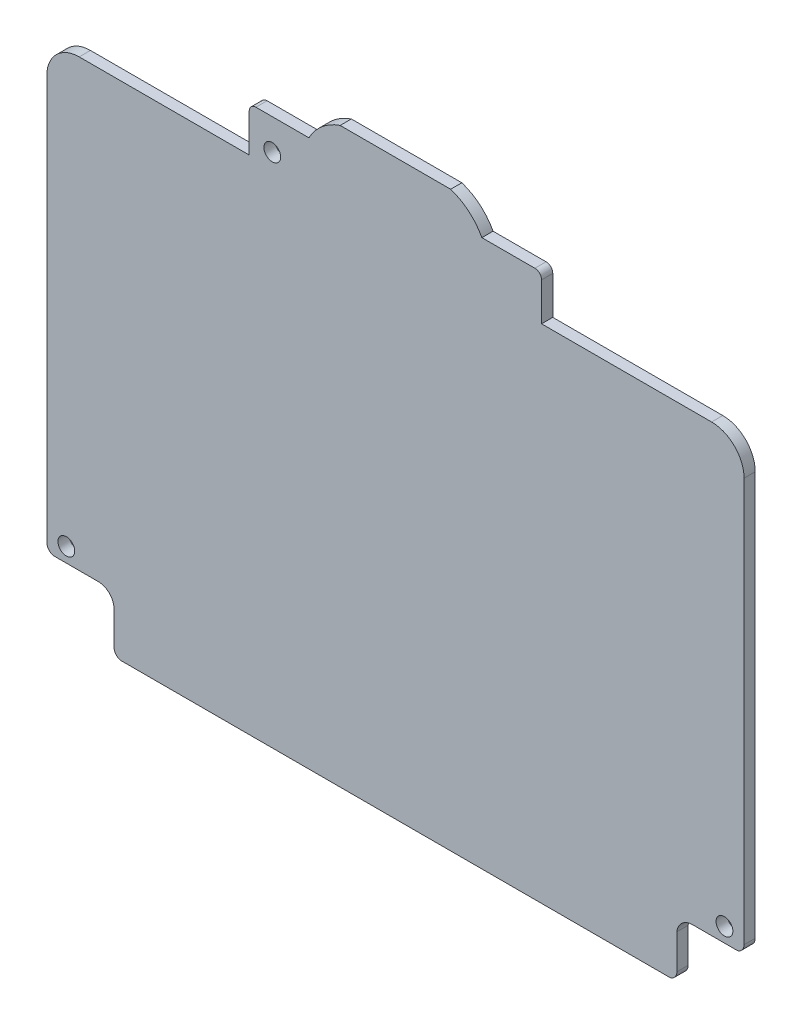
ISO-10303-21;
HEADER;
FILE_DESCRIPTION(('STEP AP214'),'2;1');
FILE_NAME('part.step','',(''),(''),'','','');
FILE_SCHEMA(('AUTOMOTIVE_DESIGN { 1 0 10303 214 1 1 1 1 }'));
ENDSEC;
DATA;
#1=APPLICATION_CONTEXT('core data for automotive mechanical design processes');
#2=APPLICATION_PROTOCOL_DEFINITION('international standard','automotive_design',2000,#1);
#3=PRODUCT_CONTEXT('',#1,'mechanical');
#4=PRODUCT('Part','Part','',(#3));
#5=PRODUCT_RELATED_PRODUCT_CATEGORY('part','',(#4));
#6=PRODUCT_DEFINITION_FORMATION('','',#4);
#7=PRODUCT_DEFINITION_CONTEXT('part definition',#1,'design');
#8=PRODUCT_DEFINITION('design','',#6,#7);
#9=PRODUCT_DEFINITION_SHAPE('','',#8);
#10=(LENGTH_UNIT() NAMED_UNIT(*) SI_UNIT(.MILLI.,.METRE.));
#11=(NAMED_UNIT(*) PLANE_ANGLE_UNIT() SI_UNIT($,.RADIAN.));
#12=(NAMED_UNIT(*) SI_UNIT($,.STERADIAN.) SOLID_ANGLE_UNIT());
#13=UNCERTAINTY_MEASURE_WITH_UNIT(LENGTH_MEASURE(1.E-05),#10,'distance_accuracy_value','');
#14=(GEOMETRIC_REPRESENTATION_CONTEXT(3) GLOBAL_UNCERTAINTY_ASSIGNED_CONTEXT((#13)) GLOBAL_UNIT_ASSIGNED_CONTEXT((#10,
#11,#12)) REPRESENTATION_CONTEXT('',''));
#15=CARTESIAN_POINT('',(0.,0.,0.));
#16=DIRECTION('',(0.,0.,1.));
#17=DIRECTION('',(1.,0.,0.));
#18=AXIS2_PLACEMENT_3D('',#15,#16,#17);
#19=CARTESIAN_POINT('',(26.55,-61.7089999999461,1.));
#20=DIRECTION('',(0.,0.,-1.));
#21=DIRECTION('',(-1.,0.,0.));
#22=AXIS2_PLACEMENT_3D('',#19,#20,#21);
#23=CYLINDRICAL_SURFACE('',#22,1.409);
#24=CARTESIAN_POINT('',(26.55,-61.7089999999461,0.));
#25=DIRECTION('',(0.,0.,-1.));
#26=DIRECTION('',(1.,0.,0.));
#27=AXIS2_PLACEMENT_3D('',#24,#25,#26);
#28=CIRCLE('',#27,1.409);
#29=CARTESIAN_POINT('',(25.15,-61.5499999999461,0.));
#30=VERTEX_POINT('',#29);
#31=CARTESIAN_POINT('',(26.55,-60.2999999999461,0.));
#32=VERTEX_POINT('',#31);
#33=EDGE_CURVE('E237',#30,#32,#28,.T.);
#34=ORIENTED_EDGE('',*,*,#33,.T.);
#35=DIRECTION('',(0.,0.,-1.));
#36=VECTOR('',#35,1.);
#37=CARTESIAN_POINT('',(26.55,-60.2999999999461,1.));
#38=LINE('',#37,#36);
#39=CARTESIAN_POINT('',(26.55,-60.2999999999461,1.));
#40=VERTEX_POINT('',#39);
#41=EDGE_CURVE('E11',#40,#32,#38,.T.);
#42=ORIENTED_EDGE('',*,*,#41,.F.);
#43=CARTESIAN_POINT('',(26.55,-61.7089999999461,1.));
#44=DIRECTION('',(0.,0.,-1.));
#45=DIRECTION('',(1.,0.,0.));
#46=AXIS2_PLACEMENT_3D('',#43,#44,#45);
#47=CIRCLE('',#46,1.409);
#48=CARTESIAN_POINT('',(25.15,-61.5499999999461,1.));
#49=VERTEX_POINT('',#48);
#50=EDGE_CURVE('E288',#49,#40,#47,.T.);
#51=ORIENTED_EDGE('',*,*,#50,.F.);
#52=DIRECTION('',(0.,0.,-1.));
#53=VECTOR('',#52,1.);
#54=CARTESIAN_POINT('',(25.15,-61.5499999999461,1.));
#55=LINE('',#54,#53);
#56=EDGE_CURVE('E233',#49,#30,#55,.T.);
#57=ORIENTED_EDGE('',*,*,#56,.T.);
#58=EDGE_LOOP('',(#34,#42,#51,#57));
#59=FACE_BOUND('',#58,.T.);
#60=ADVANCED_FACE('F33',(#59),#23,.F.);
#61=CARTESIAN_POINT('',(26.55,-60.2999999999461,1.));
#62=DIRECTION('',(0.,1.,0.));
#63=DIRECTION('',(0.,0.,1.));
#64=AXIS2_PLACEMENT_3D('',#61,#62,#63);
#65=PLANE('',#64);
#66=DIRECTION('',(1.,0.,0.));
#67=VECTOR('',#66,1.);
#68=CARTESIAN_POINT('',(26.55,-60.2999999999461,0.));
#69=LINE('',#68,#67);
#70=CARTESIAN_POINT('',(30.55,-60.2999999999461,0.));
#71=VERTEX_POINT('',#70);
#72=EDGE_CURVE('E240',#32,#71,#69,.T.);
#73=ORIENTED_EDGE('',*,*,#72,.T.);
#74=DIRECTION('',(0.,0.,-1.));
#75=VECTOR('',#74,1.);
#76=CARTESIAN_POINT('',(30.55,-60.2999999999461,1.));
#77=LINE('',#76,#75);
#78=CARTESIAN_POINT('',(30.55,-60.2999999999461,1.));
#79=VERTEX_POINT('',#78);
#80=EDGE_CURVE('E41',#79,#71,#77,.T.);
#81=ORIENTED_EDGE('',*,*,#80,.F.);
#82=DIRECTION('',(1.,0.,0.));
#83=VECTOR('',#82,1.);
#84=CARTESIAN_POINT('',(26.55,-60.2999999999461,1.));
#85=LINE('',#84,#83);
#86=EDGE_CURVE('E146',#40,#79,#85,.T.);
#87=ORIENTED_EDGE('',*,*,#86,.F.);
#88=ORIENTED_EDGE('',*,*,#41,.T.);
#89=EDGE_LOOP('',(#73,#81,#87,#88));
#90=FACE_BOUND('',#89,.T.);
#91=ADVANCED_FACE('F437',(#90),#65,.F.);
#92=CARTESIAN_POINT('',(30.38125,-59.5499999999461,1.));
#93=DIRECTION('',(0.,0.,-1.));
#94=DIRECTION('',(-1.,0.,0.));
#95=AXIS2_PLACEMENT_3D('',#92,#93,#94);
#96=CYLINDRICAL_SURFACE('',#95,0.768749999999999);
#97=CARTESIAN_POINT('',(30.38125,-59.5499999999461,0.));
#98=DIRECTION('',(0.,0.,1.));
#99=DIRECTION('',(-1.,0.,0.));
#100=AXIS2_PLACEMENT_3D('',#97,#98,#99);
#101=CIRCLE('',#100,0.768749999999999);
#102=CARTESIAN_POINT('',(31.15,-59.5499999999461,0.));
#103=VERTEX_POINT('',#102);
#104=EDGE_CURVE('E243',#71,#103,#101,.T.);
#105=ORIENTED_EDGE('',*,*,#104,.T.);
#106=DIRECTION('',(0.,0.,-1.));
#107=VECTOR('',#106,1.);
#108=CARTESIAN_POINT('',(31.15,-59.5499999999461,1.));
#109=LINE('',#108,#107);
#110=CARTESIAN_POINT('',(31.15,-59.5499999999461,1.));
#111=VERTEX_POINT('',#110);
#112=EDGE_CURVE('E349',#111,#103,#109,.T.);
#113=ORIENTED_EDGE('',*,*,#112,.F.);
#114=CARTESIAN_POINT('',(30.38125,-59.5499999999461,1.));
#115=DIRECTION('',(0.,0.,1.));
#116=DIRECTION('',(-1.,0.,0.));
#117=AXIS2_PLACEMENT_3D('',#114,#115,#116);
#118=CIRCLE('',#117,0.768749999999999);
#119=EDGE_CURVE('E357',#79,#111,#118,.T.);
#120=ORIENTED_EDGE('',*,*,#119,.F.);
#121=ORIENTED_EDGE('',*,*,#80,.T.);
#122=EDGE_LOOP('',(#105,#113,#120,#121));
#123=FACE_BOUND('',#122,.T.);
#124=ADVANCED_FACE('F355',(#123),#96,.T.);
#125=CARTESIAN_POINT('',(31.15,-59.5499999999461,1.));
#126=DIRECTION('',(-1.,0.,0.));
#127=DIRECTION('',(0.,-1.,0.));
#128=AXIS2_PLACEMENT_3D('',#125,#126,#127);
#129=PLANE('',#128);
#130=DIRECTION('',(0.,1.,0.));
#131=VECTOR('',#130,1.);
#132=CARTESIAN_POINT('',(31.15,-59.5499999999461,0.));
#133=LINE('',#132,#131);
#134=CARTESIAN_POINT('',(31.15,-23.45,0.));
#135=VERTEX_POINT('',#134);
#136=EDGE_CURVE('E245',#103,#135,#133,.T.);
#137=ORIENTED_EDGE('',*,*,#136,.T.);
#138=DIRECTION('',(0.,0.,-1.));
#139=VECTOR('',#138,1.);
#140=CARTESIAN_POINT('',(31.15,-23.45,1.));
#141=LINE('',#140,#139);
#142=CARTESIAN_POINT('',(31.15,-23.45,1.));
#143=VERTEX_POINT('',#142);
#144=EDGE_CURVE('E346',#143,#135,#141,.T.);
#145=ORIENTED_EDGE('',*,*,#144,.F.);
#146=DIRECTION('',(0.,1.,0.));
#147=VECTOR('',#146,1.);
#148=CARTESIAN_POINT('',(31.15,-59.5499999999461,1.));
#149=LINE('',#148,#147);
#150=EDGE_CURVE('E375',#111,#143,#149,.T.);
#151=ORIENTED_EDGE('',*,*,#150,.F.);
#152=ORIENTED_EDGE('',*,*,#112,.T.);
#153=EDGE_LOOP('',(#137,#145,#151,#152));
#154=FACE_BOUND('',#153,.T.);
#155=ADVANCED_FACE('F366',(#154),#129,.F.);
#156=CARTESIAN_POINT('',(28.25,-23.45,1.));
#157=DIRECTION('',(0.,0.,-1.));
#158=DIRECTION('',(-1.,0.,0.));
#159=AXIS2_PLACEMENT_3D('',#156,#157,#158);
#160=CYLINDRICAL_SURFACE('',#159,2.9);
#161=CARTESIAN_POINT('',(28.25,-23.45,0.));
#162=DIRECTION('',(0.,0.,1.));
#163=DIRECTION('',(1.,0.,0.));
#164=AXIS2_PLACEMENT_3D('',#161,#162,#163);
#165=CIRCLE('',#164,2.9);
#166=CARTESIAN_POINT('',(28.25,-20.55,0.));
#167=VERTEX_POINT('',#166);
#168=EDGE_CURVE('E247',#135,#167,#165,.T.);
#169=ORIENTED_EDGE('',*,*,#168,.T.);
#170=DIRECTION('',(0.,0.,-1.));
#171=VECTOR('',#170,1.);
#172=CARTESIAN_POINT('',(28.25,-20.55,1.));
#173=LINE('',#172,#171);
#174=CARTESIAN_POINT('',(28.25,-20.55,1.));
#175=VERTEX_POINT('',#174);
#176=EDGE_CURVE('E343',#175,#167,#173,.T.);
#177=ORIENTED_EDGE('',*,*,#176,.F.);
#178=CARTESIAN_POINT('',(28.25,-23.45,1.));
#179=DIRECTION('',(0.,0.,1.));
#180=DIRECTION('',(1.,0.,0.));
#181=AXIS2_PLACEMENT_3D('',#178,#179,#180);
#182=CIRCLE('',#181,2.9);
#183=EDGE_CURVE('E372',#143,#175,#182,.T.);
#184=ORIENTED_EDGE('',*,*,#183,.F.);
#185=ORIENTED_EDGE('',*,*,#144,.T.);
#186=EDGE_LOOP('',(#169,#177,#184,#185));
#187=FACE_BOUND('',#186,.T.);
#188=ADVANCED_FACE('F370',(#187),#160,.T.);
#189=CARTESIAN_POINT('',(28.25,-20.55,1.));
#190=DIRECTION('',(0.,-1.,0.));
#191=DIRECTION('',(1.,0.,0.));
#192=AXIS2_PLACEMENT_3D('',#189,#190,#191);
#193=PLANE('',#192);
#194=DIRECTION('',(-1.,0.,0.));
#195=VECTOR('',#194,1.);
#196=CARTESIAN_POINT('',(28.25,-20.55,0.));
#197=LINE('',#196,#195);
#198=CARTESIAN_POINT('',(13.0607017003965,-20.55,0.));
#199=VERTEX_POINT('',#198);
#200=EDGE_CURVE('E249',#167,#199,#197,.T.);
#201=ORIENTED_EDGE('',*,*,#200,.T.);
#202=DIRECTION('',(0.,0.,-1.));
#203=VECTOR('',#202,1.);
#204=CARTESIAN_POINT('',(13.0607017003965,-20.55,1.));
#205=LINE('',#204,#203);
#206=CARTESIAN_POINT('',(13.0607017003965,-20.55,1.));
#207=VERTEX_POINT('',#206);
#208=EDGE_CURVE('E340',#207,#199,#205,.T.);
#209=ORIENTED_EDGE('',*,*,#208,.F.);
#210=DIRECTION('',(-1.,0.,0.));
#211=VECTOR('',#210,1.);
#212=CARTESIAN_POINT('',(28.25,-20.55,1.));
#213=LINE('',#212,#211);
#214=EDGE_CURVE('E374',#175,#207,#213,.T.);
#215=ORIENTED_EDGE('',*,*,#214,.F.);
#216=ORIENTED_EDGE('',*,*,#176,.T.);
#217=EDGE_LOOP('',(#201,#209,#215,#216));
#218=FACE_BOUND('',#217,.T.);
#219=ADVANCED_FACE('F450',(#218),#193,.F.);
#220=CARTESIAN_POINT('',(13.0607017003965,-20.55,1.));
#221=DIRECTION('',(-1.,0.,0.));
#222=DIRECTION('',(0.,-1.,0.));
#223=AXIS2_PLACEMENT_3D('',#220,#221,#222);
#224=PLANE('',#223);
#225=DIRECTION('',(0.,1.,0.));
#226=VECTOR('',#225,1.);
#227=CARTESIAN_POINT('',(13.0607017003965,-20.55,0.));
#228=LINE('',#227,#226);
#229=CARTESIAN_POINT('',(13.0607017003965,-17.15,0.));
#230=VERTEX_POINT('',#229);
#231=EDGE_CURVE('E251',#199,#230,#228,.T.);
#232=ORIENTED_EDGE('',*,*,#231,.T.);
#233=DIRECTION('',(0.,0.,-1.));
#234=VECTOR('',#233,1.);
#235=CARTESIAN_POINT('',(13.0607017003965,-17.15,1.));
#236=LINE('',#235,#234);
#237=CARTESIAN_POINT('',(13.0607017003965,-17.15,1.));
#238=VERTEX_POINT('',#237);
#239=EDGE_CURVE('E337',#238,#230,#236,.T.);
#240=ORIENTED_EDGE('',*,*,#239,.F.);
#241=DIRECTION('',(0.,1.,0.));
#242=VECTOR('',#241,1.);
#243=CARTESIAN_POINT('',(13.0607017003965,-20.55,1.));
#244=LINE('',#243,#242);
#245=EDGE_CURVE('E377',#207,#238,#244,.T.);
#246=ORIENTED_EDGE('',*,*,#245,.F.);
#247=ORIENTED_EDGE('',*,*,#208,.T.);
#248=EDGE_LOOP('',(#232,#240,#246,#247));
#249=FACE_BOUND('',#248,.T.);
#250=ADVANCED_FACE('F453',(#249),#224,.F.);
#251=CARTESIAN_POINT('',(12.4607017003965,-17.15,1.));
#252=DIRECTION('',(0.,0.,-1.));
#253=DIRECTION('',(-1.,0.,0.));
#254=AXIS2_PLACEMENT_3D('',#251,#252,#253);
#255=CYLINDRICAL_SURFACE('',#254,0.600000000000001);
#256=CARTESIAN_POINT('',(12.4607017003965,-17.15,0.));
#257=DIRECTION('',(0.,0.,1.));
#258=DIRECTION('',(1.,0.,0.));
#259=AXIS2_PLACEMENT_3D('',#256,#257,#258);
#260=CIRCLE('',#259,0.600000000000001);
#261=CARTESIAN_POINT('',(12.4607017003965,-16.55,0.));
#262=VERTEX_POINT('',#261);
#263=EDGE_CURVE('E253',#230,#262,#260,.T.);
#264=ORIENTED_EDGE('',*,*,#263,.T.);
#265=DIRECTION('',(0.,0.,-1.));
#266=VECTOR('',#265,1.);
#267=CARTESIAN_POINT('',(12.4607017003965,-16.55,1.));
#268=LINE('',#267,#266);
#269=CARTESIAN_POINT('',(12.4607017003965,-16.55,1.));
#270=VERTEX_POINT('',#269);
#271=EDGE_CURVE('E334',#270,#262,#268,.T.);
#272=ORIENTED_EDGE('',*,*,#271,.F.);
#273=CARTESIAN_POINT('',(12.4607017003965,-17.15,1.));
#274=DIRECTION('',(0.,0.,1.));
#275=DIRECTION('',(1.,0.,0.));
#276=AXIS2_PLACEMENT_3D('',#273,#274,#275);
#277=CIRCLE('',#276,0.600000000000001);
#278=EDGE_CURVE('E383',#238,#270,#277,.T.);
#279=ORIENTED_EDGE('',*,*,#278,.F.);
#280=ORIENTED_EDGE('',*,*,#239,.T.);
#281=EDGE_LOOP('',(#264,#272,#279,#280));
#282=FACE_BOUND('',#281,.T.);
#283=ADVANCED_FACE('F457',(#282),#255,.T.);
#284=CARTESIAN_POINT('',(12.4607017003965,-16.55,1.));
#285=DIRECTION('',(0.,-1.,0.));
#286=DIRECTION('',(1.,0.,0.));
#287=AXIS2_PLACEMENT_3D('',#284,#285,#286);
#288=PLANE('',#287);
#289=DIRECTION('',(-1.,0.,0.));
#290=VECTOR('',#289,1.);
#291=CARTESIAN_POINT('',(12.4607017003965,-16.55,0.));
#292=LINE('',#291,#290);
#293=CARTESIAN_POINT('',(7.72666153055681,-16.55,0.));
#294=VERTEX_POINT('',#293);
#295=EDGE_CURVE('E255',#262,#294,#292,.T.);
#296=ORIENTED_EDGE('',*,*,#295,.T.);
#297=DIRECTION('',(0.,0.,-1.));
#298=VECTOR('',#297,1.);
#299=CARTESIAN_POINT('',(7.72666153055681,-16.55,1.));
#300=LINE('',#299,#298);
#301=CARTESIAN_POINT('',(7.72666153055681,-16.55,1.));
#302=VERTEX_POINT('',#301);
#303=EDGE_CURVE('E331',#302,#294,#300,.T.);
#304=ORIENTED_EDGE('',*,*,#303,.F.);
#305=DIRECTION('',(-1.,0.,0.));
#306=VECTOR('',#305,1.);
#307=CARTESIAN_POINT('',(12.4607017003965,-16.55,1.));
#308=LINE('',#307,#306);
#309=EDGE_CURVE('E385',#270,#302,#308,.T.);
#310=ORIENTED_EDGE('',*,*,#309,.F.);
#311=ORIENTED_EDGE('',*,*,#271,.T.);
#312=EDGE_LOOP('',(#296,#304,#310,#311));
#313=FACE_BOUND('',#312,.T.);
#314=ADVANCED_FACE('F461',(#313),#288,.F.);
#315=CARTESIAN_POINT('',(3.4,-18.85,1.));
#316=DIRECTION('',(0.,0.,-1.));
#317=DIRECTION('',(-1.,0.,0.));
#318=AXIS2_PLACEMENT_3D('',#315,#316,#317);
#319=CYLINDRICAL_SURFACE('',#318,4.90000000000002);
#320=CARTESIAN_POINT('',(3.4,-18.85,0.));
#321=DIRECTION('',(0.,0.,1.));
#322=DIRECTION('',(1.,0.,0.));
#323=AXIS2_PLACEMENT_3D('',#320,#321,#322);
#324=CIRCLE('',#323,4.90000000000002);
#325=CARTESIAN_POINT('',(4.93693774465048,-14.1972779613361,0.));
#326=VERTEX_POINT('',#325);
#327=EDGE_CURVE('E257',#294,#326,#324,.T.);
#328=ORIENTED_EDGE('',*,*,#327,.T.);
#329=DIRECTION('',(0.,0.,-1.));
#330=VECTOR('',#329,1.);
#331=CARTESIAN_POINT('',(4.93693774465048,-14.1972779613361,1.));
#332=LINE('',#331,#330);
#333=CARTESIAN_POINT('',(4.93693774465048,-14.1972779613361,1.));
#334=VERTEX_POINT('',#333);
#335=EDGE_CURVE('E328',#334,#326,#332,.T.);
#336=ORIENTED_EDGE('',*,*,#335,.F.);
#337=CARTESIAN_POINT('',(3.4,-18.85,1.));
#338=DIRECTION('',(0.,0.,1.));
#339=DIRECTION('',(1.,0.,0.));
#340=AXIS2_PLACEMENT_3D('',#337,#338,#339);
#341=CIRCLE('',#340,4.90000000000002);
#342=EDGE_CURVE('E387',#302,#334,#341,.T.);
#343=ORIENTED_EDGE('',*,*,#342,.F.);
#344=ORIENTED_EDGE('',*,*,#303,.T.);
#345=EDGE_LOOP('',(#328,#336,#343,#344));
#346=FACE_BOUND('',#345,.T.);
#347=ADVANCED_FACE('F465',(#346),#319,.T.);
#348=CARTESIAN_POINT('',(4.93693774465048,-14.1972779613361,1.));
#349=DIRECTION('',(0.,-1.,0.));
#350=DIRECTION('',(1.,0.,0.));
#351=AXIS2_PLACEMENT_3D('',#348,#349,#350);
#352=PLANE('',#351);
#353=DIRECTION('',(-1.,0.,0.));
#354=VECTOR('',#353,1.);
#355=CARTESIAN_POINT('',(4.93693774465048,-14.1972779613361,0.));
#356=LINE('',#355,#354);
#357=CARTESIAN_POINT('',(-4.93693774465048,-14.1972779613361,0.));
#358=VERTEX_POINT('',#357);
#359=EDGE_CURVE('E259',#326,#358,#356,.T.);
#360=ORIENTED_EDGE('',*,*,#359,.T.);
#361=DIRECTION('',(0.,0.,-1.));
#362=VECTOR('',#361,1.);
#363=CARTESIAN_POINT('',(-4.93693774465048,-14.1972779613361,1.));
#364=LINE('',#363,#362);
#365=CARTESIAN_POINT('',(-4.93693774465048,-14.1972779613361,1.));
#366=VERTEX_POINT('',#365);
#367=EDGE_CURVE('E325',#366,#358,#364,.T.);
#368=ORIENTED_EDGE('',*,*,#367,.F.);
#369=DIRECTION('',(-1.,0.,0.));
#370=VECTOR('',#369,1.);
#371=CARTESIAN_POINT('',(4.93693774465048,-14.1972779613361,1.));
#372=LINE('',#371,#370);
#373=EDGE_CURVE('E389',#334,#366,#372,.T.);
#374=ORIENTED_EDGE('',*,*,#373,.F.);
#375=ORIENTED_EDGE('',*,*,#335,.T.);
#376=EDGE_LOOP('',(#360,#368,#374,#375));
#377=FACE_BOUND('',#376,.T.);
#378=ADVANCED_FACE('F469',(#377),#352,.F.);
#379=CARTESIAN_POINT('',(-3.4,-18.85,1.));
#380=DIRECTION('',(0.,0.,-1.));
#381=DIRECTION('',(-1.,0.,0.));
#382=AXIS2_PLACEMENT_3D('',#379,#380,#381);
#383=CYLINDRICAL_SURFACE('',#382,4.90000000000002);
#384=CARTESIAN_POINT('',(-3.4,-18.85,0.));
#385=DIRECTION('',(0.,0.,1.));
#386=DIRECTION('',(1.,0.,0.));
#387=AXIS2_PLACEMENT_3D('',#384,#385,#386);
#388=CIRCLE('',#387,4.90000000000002);
#389=CARTESIAN_POINT('',(-7.72666153055681,-16.55,0.));
#390=VERTEX_POINT('',#389);
#391=EDGE_CURVE('E261',#358,#390,#388,.T.);
#392=ORIENTED_EDGE('',*,*,#391,.T.);
#393=DIRECTION('',(0.,0.,-1.));
#394=VECTOR('',#393,1.);
#395=CARTESIAN_POINT('',(-7.72666153055681,-16.55,1.));
#396=LINE('',#395,#394);
#397=CARTESIAN_POINT('',(-7.72666153055681,-16.55,1.));
#398=VERTEX_POINT('',#397);
#399=EDGE_CURVE('E322',#398,#390,#396,.T.);
#400=ORIENTED_EDGE('',*,*,#399,.F.);
#401=CARTESIAN_POINT('',(-3.4,-18.85,1.));
#402=DIRECTION('',(0.,0.,1.));
#403=DIRECTION('',(1.,0.,0.));
#404=AXIS2_PLACEMENT_3D('',#401,#402,#403);
#405=CIRCLE('',#404,4.90000000000002);
#406=EDGE_CURVE('E391',#366,#398,#405,.T.);
#407=ORIENTED_EDGE('',*,*,#406,.F.);
#408=ORIENTED_EDGE('',*,*,#367,.T.);
#409=EDGE_LOOP('',(#392,#400,#407,#408));
#410=FACE_BOUND('',#409,.T.);
#411=ADVANCED_FACE('F473',(#410),#383,.T.);
#412=CARTESIAN_POINT('',(-7.72666153055681,-16.55,1.));
#413=DIRECTION('',(0.,-1.,0.));
#414=DIRECTION('',(1.,0.,0.));
#415=AXIS2_PLACEMENT_3D('',#412,#413,#414);
#416=PLANE('',#415);
#417=DIRECTION('',(-1.,0.,0.));
#418=VECTOR('',#417,1.);
#419=CARTESIAN_POINT('',(-7.72666153055681,-16.55,0.));
#420=LINE('',#419,#418);
#421=CARTESIAN_POINT('',(-12.4607017003965,-16.55,0.));
#422=VERTEX_POINT('',#421);
#423=EDGE_CURVE('E263',#390,#422,#420,.T.);
#424=ORIENTED_EDGE('',*,*,#423,.T.);
#425=DIRECTION('',(0.,0.,-1.));
#426=VECTOR('',#425,1.);
#427=CARTESIAN_POINT('',(-12.4607017003965,-16.55,1.));
#428=LINE('',#427,#426);
#429=CARTESIAN_POINT('',(-12.4607017003965,-16.55,1.));
#430=VERTEX_POINT('',#429);
#431=EDGE_CURVE('E319',#430,#422,#428,.T.);
#432=ORIENTED_EDGE('',*,*,#431,.F.);
#433=DIRECTION('',(-1.,0.,0.));
#434=VECTOR('',#433,1.);
#435=CARTESIAN_POINT('',(-7.72666153055681,-16.55,1.));
#436=LINE('',#435,#434);
#437=EDGE_CURVE('E393',#398,#430,#436,.T.);
#438=ORIENTED_EDGE('',*,*,#437,.F.);
#439=ORIENTED_EDGE('',*,*,#399,.T.);
#440=EDGE_LOOP('',(#424,#432,#438,#439));
#441=FACE_BOUND('',#440,.T.);
#442=ADVANCED_FACE('F477',(#441),#416,.F.);
#443=CARTESIAN_POINT('',(-12.4607017003966,-17.15,1.));
#444=DIRECTION('',(0.,0.,-1.));
#445=DIRECTION('',(-1.,0.,0.));
#446=AXIS2_PLACEMENT_3D('',#443,#444,#445);
#447=CYLINDRICAL_SURFACE('',#446,0.599999999999997);
#448=CARTESIAN_POINT('',(-12.4607017003966,-17.15,0.));
#449=DIRECTION('',(0.,0.,1.));
#450=DIRECTION('',(1.,0.,0.));
#451=AXIS2_PLACEMENT_3D('',#448,#449,#450);
#452=CIRCLE('',#451,0.599999999999997);
#453=CARTESIAN_POINT('',(-13.0607017003965,-17.15,0.));
#454=VERTEX_POINT('',#453);
#455=EDGE_CURVE('E265',#422,#454,#452,.T.);
#456=ORIENTED_EDGE('',*,*,#455,.T.);
#457=DIRECTION('',(0.,0.,-1.));
#458=VECTOR('',#457,1.);
#459=CARTESIAN_POINT('',(-13.0607017003965,-17.15,1.));
#460=LINE('',#459,#458);
#461=CARTESIAN_POINT('',(-13.0607017003965,-17.15,1.));
#462=VERTEX_POINT('',#461);
#463=EDGE_CURVE('E316',#462,#454,#460,.T.);
#464=ORIENTED_EDGE('',*,*,#463,.F.);
#465=CARTESIAN_POINT('',(-12.4607017003966,-17.15,1.));
#466=DIRECTION('',(0.,0.,1.));
#467=DIRECTION('',(1.,0.,0.));
#468=AXIS2_PLACEMENT_3D('',#465,#466,#467);
#469=CIRCLE('',#468,0.599999999999997);
#470=EDGE_CURVE('E395',#430,#462,#469,.T.);
#471=ORIENTED_EDGE('',*,*,#470,.F.);
#472=ORIENTED_EDGE('',*,*,#431,.T.);
#473=EDGE_LOOP('',(#456,#464,#471,#472));
#474=FACE_BOUND('',#473,.T.);
#475=ADVANCED_FACE('F481',(#474),#447,.T.);
#476=CARTESIAN_POINT('',(-13.0607017003965,-17.15,1.));
#477=DIRECTION('',(1.,0.,0.));
#478=DIRECTION('',(0.,1.,0.));
#479=AXIS2_PLACEMENT_3D('',#476,#477,#478);
#480=PLANE('',#479);
#481=DIRECTION('',(0.,-1.,0.));
#482=VECTOR('',#481,1.);
#483=CARTESIAN_POINT('',(-13.0607017003965,-17.15,0.));
#484=LINE('',#483,#482);
#485=CARTESIAN_POINT('',(-13.0607017003965,-20.55,0.));
#486=VERTEX_POINT('',#485);
#487=EDGE_CURVE('E267',#454,#486,#484,.T.);
#488=ORIENTED_EDGE('',*,*,#487,.T.);
#489=DIRECTION('',(0.,0.,-1.));
#490=VECTOR('',#489,1.);
#491=CARTESIAN_POINT('',(-13.0607017003965,-20.55,1.));
#492=LINE('',#491,#490);
#493=CARTESIAN_POINT('',(-13.0607017003965,-20.55,1.));
#494=VERTEX_POINT('',#493);
#495=EDGE_CURVE('E313',#494,#486,#492,.T.);
#496=ORIENTED_EDGE('',*,*,#495,.F.);
#497=DIRECTION('',(0.,-1.,0.));
#498=VECTOR('',#497,1.);
#499=CARTESIAN_POINT('',(-13.0607017003965,-17.15,1.));
#500=LINE('',#499,#498);
#501=EDGE_CURVE('E397',#462,#494,#500,.T.);
#502=ORIENTED_EDGE('',*,*,#501,.F.);
#503=ORIENTED_EDGE('',*,*,#463,.T.);
#504=EDGE_LOOP('',(#488,#496,#502,#503));
#505=FACE_BOUND('',#504,.T.);
#506=ADVANCED_FACE('F485',(#505),#480,.F.);
#507=CARTESIAN_POINT('',(-13.0607017003965,-20.55,1.));
#508=DIRECTION('',(0.,-1.,0.));
#509=DIRECTION('',(1.,0.,0.));
#510=AXIS2_PLACEMENT_3D('',#507,#508,#509);
#511=PLANE('',#510);
#512=DIRECTION('',(-1.,0.,0.));
#513=VECTOR('',#512,1.);
#514=CARTESIAN_POINT('',(-13.0607017003965,-20.55,0.));
#515=LINE('',#514,#513);
#516=CARTESIAN_POINT('',(-28.25,-20.55,0.));
#517=VERTEX_POINT('',#516);
#518=EDGE_CURVE('E269',#486,#517,#515,.T.);
#519=ORIENTED_EDGE('',*,*,#518,.T.);
#520=DIRECTION('',(0.,0.,-1.));
#521=VECTOR('',#520,1.);
#522=CARTESIAN_POINT('',(-28.25,-20.55,1.));
#523=LINE('',#522,#521);
#524=CARTESIAN_POINT('',(-28.25,-20.55,1.));
#525=VERTEX_POINT('',#524);
#526=EDGE_CURVE('E310',#525,#517,#523,.T.);
#527=ORIENTED_EDGE('',*,*,#526,.F.);
#528=DIRECTION('',(-1.,0.,0.));
#529=VECTOR('',#528,1.);
#530=CARTESIAN_POINT('',(-13.0607017003965,-20.55,1.));
#531=LINE('',#530,#529);
#532=EDGE_CURVE('E399',#494,#525,#531,.T.);
#533=ORIENTED_EDGE('',*,*,#532,.F.);
#534=ORIENTED_EDGE('',*,*,#495,.T.);
#535=EDGE_LOOP('',(#519,#527,#533,#534));
#536=FACE_BOUND('',#535,.T.);
#537=ADVANCED_FACE('F489',(#536),#511,.F.);
#538=CARTESIAN_POINT('',(-28.25,-23.45,1.));
#539=DIRECTION('',(0.,0.,-1.));
#540=DIRECTION('',(-1.,0.,0.));
#541=AXIS2_PLACEMENT_3D('',#538,#539,#540);
#542=CYLINDRICAL_SURFACE('',#541,2.90000000000001);
#543=CARTESIAN_POINT('',(-28.25,-23.45,0.));
#544=DIRECTION('',(0.,0.,1.));
#545=DIRECTION('',(1.,0.,0.));
#546=AXIS2_PLACEMENT_3D('',#543,#544,#545);
#547=CIRCLE('',#546,2.90000000000001);
#548=CARTESIAN_POINT('',(-31.15,-23.45,0.));
#549=VERTEX_POINT('',#548);
#550=EDGE_CURVE('E271',#517,#549,#547,.T.);
#551=ORIENTED_EDGE('',*,*,#550,.T.);
#552=DIRECTION('',(0.,0.,-1.));
#553=VECTOR('',#552,1.);
#554=CARTESIAN_POINT('',(-31.15,-23.45,1.));
#555=LINE('',#554,#553);
#556=CARTESIAN_POINT('',(-31.15,-23.45,1.));
#557=VERTEX_POINT('',#556);
#558=EDGE_CURVE('E307',#557,#549,#555,.T.);
#559=ORIENTED_EDGE('',*,*,#558,.F.);
#560=CARTESIAN_POINT('',(-28.25,-23.45,1.));
#561=DIRECTION('',(0.,0.,1.));
#562=DIRECTION('',(1.,0.,0.));
#563=AXIS2_PLACEMENT_3D('',#560,#561,#562);
#564=CIRCLE('',#563,2.90000000000001);
#565=EDGE_CURVE('E401',#525,#557,#564,.T.);
#566=ORIENTED_EDGE('',*,*,#565,.F.);
#567=ORIENTED_EDGE('',*,*,#526,.T.);
#568=EDGE_LOOP('',(#551,#559,#566,#567));
#569=FACE_BOUND('',#568,.T.);
#570=ADVANCED_FACE('F493',(#569),#542,.T.);
#571=CARTESIAN_POINT('',(-31.15,-23.45,1.));
#572=DIRECTION('',(1.,0.,0.));
#573=DIRECTION('',(0.,1.,0.));
#574=AXIS2_PLACEMENT_3D('',#571,#572,#573);
#575=PLANE('',#574);
#576=DIRECTION('',(0.,-1.,0.));
#577=VECTOR('',#576,1.);
#578=CARTESIAN_POINT('',(-31.15,-23.45,0.));
#579=LINE('',#578,#577);
#580=CARTESIAN_POINT('',(-31.15,-59.5499999999461,0.));
#581=VERTEX_POINT('',#580);
#582=EDGE_CURVE('E273',#549,#581,#579,.T.);
#583=ORIENTED_EDGE('',*,*,#582,.T.);
#584=DIRECTION('',(0.,0.,-1.));
#585=VECTOR('',#584,1.);
#586=CARTESIAN_POINT('',(-31.15,-59.5499999999461,1.));
#587=LINE('',#586,#585);
#588=CARTESIAN_POINT('',(-31.15,-59.5499999999461,1.));
#589=VERTEX_POINT('',#588);
#590=EDGE_CURVE('E304',#589,#581,#587,.T.);
#591=ORIENTED_EDGE('',*,*,#590,.F.);
#592=DIRECTION('',(0.,-1.,0.));
#593=VECTOR('',#592,1.);
#594=CARTESIAN_POINT('',(-31.15,-23.45,1.));
#595=LINE('',#594,#593);
#596=EDGE_CURVE('E403',#557,#589,#595,.T.);
#597=ORIENTED_EDGE('',*,*,#596,.F.);
#598=ORIENTED_EDGE('',*,*,#558,.T.);
#599=EDGE_LOOP('',(#583,#591,#597,#598));
#600=FACE_BOUND('',#599,.T.);
#601=ADVANCED_FACE('F497',(#600),#575,.F.);
#602=CARTESIAN_POINT('',(-30.38125,-59.5499999999461,1.));
#603=DIRECTION('',(0.,0.,-1.));
#604=DIRECTION('',(-1.,0.,0.));
#605=AXIS2_PLACEMENT_3D('',#602,#603,#604);
#606=CYLINDRICAL_SURFACE('',#605,0.768750000000007);
#607=CARTESIAN_POINT('',(-30.38125,-59.5499999999461,0.));
#608=DIRECTION('',(0.,0.,1.));
#609=DIRECTION('',(1.,0.,0.));
#610=AXIS2_PLACEMENT_3D('',#607,#608,#609);
#611=CIRCLE('',#610,0.768750000000007);
#612=CARTESIAN_POINT('',(-30.55,-60.2999999999461,0.));
#613=VERTEX_POINT('',#612);
#614=EDGE_CURVE('E275',#581,#613,#611,.T.);
#615=ORIENTED_EDGE('',*,*,#614,.T.);
#616=DIRECTION('',(0.,0.,-1.));
#617=VECTOR('',#616,1.);
#618=CARTESIAN_POINT('',(-30.55,-60.2999999999461,1.));
#619=LINE('',#618,#617);
#620=CARTESIAN_POINT('',(-30.55,-60.2999999999461,1.));
#621=VERTEX_POINT('',#620);
#622=EDGE_CURVE('E301',#621,#613,#619,.T.);
#623=ORIENTED_EDGE('',*,*,#622,.F.);
#624=CARTESIAN_POINT('',(-30.38125,-59.5499999999461,1.));
#625=DIRECTION('',(0.,0.,1.));
#626=DIRECTION('',(1.,0.,0.));
#627=AXIS2_PLACEMENT_3D('',#624,#625,#626);
#628=CIRCLE('',#627,0.768750000000007);
#629=EDGE_CURVE('E405',#589,#621,#628,.T.);
#630=ORIENTED_EDGE('',*,*,#629,.F.);
#631=ORIENTED_EDGE('',*,*,#590,.T.);
#632=EDGE_LOOP('',(#615,#623,#630,#631));
#633=FACE_BOUND('',#632,.T.);
#634=ADVANCED_FACE('F501',(#633),#606,.T.);
#635=CARTESIAN_POINT('',(-30.55,-60.2999999999461,1.));
#636=DIRECTION('',(0.,1.,0.));
#637=DIRECTION('',(0.,0.,1.));
#638=AXIS2_PLACEMENT_3D('',#635,#636,#637);
#639=PLANE('',#638);
#640=DIRECTION('',(1.,0.,0.));
#641=VECTOR('',#640,1.);
#642=CARTESIAN_POINT('',(-30.55,-60.2999999999461,0.));
#643=LINE('',#642,#641);
#644=CARTESIAN_POINT('',(-26.55,-60.2999999999461,0.));
#645=VERTEX_POINT('',#644);
#646=EDGE_CURVE('E277',#613,#645,#643,.T.);
#647=ORIENTED_EDGE('',*,*,#646,.T.);
#648=DIRECTION('',(0.,0.,-1.));
#649=VECTOR('',#648,1.);
#650=CARTESIAN_POINT('',(-26.55,-60.2999999999461,1.));
#651=LINE('',#650,#649);
#652=CARTESIAN_POINT('',(-26.55,-60.2999999999461,1.));
#653=VERTEX_POINT('',#652);
#654=EDGE_CURVE('E298',#653,#645,#651,.T.);
#655=ORIENTED_EDGE('',*,*,#654,.F.);
#656=DIRECTION('',(1.,0.,0.));
#657=VECTOR('',#656,1.);
#658=CARTESIAN_POINT('',(-30.55,-60.2999999999461,1.));
#659=LINE('',#658,#657);
#660=EDGE_CURVE('E407',#621,#653,#659,.T.);
#661=ORIENTED_EDGE('',*,*,#660,.F.);
#662=ORIENTED_EDGE('',*,*,#622,.T.);
#663=EDGE_LOOP('',(#647,#655,#661,#662));
#664=FACE_BOUND('',#663,.T.);
#665=ADVANCED_FACE('F505',(#664),#639,.F.);
#666=CARTESIAN_POINT('',(-26.55,-61.7089999999461,1.));
#667=DIRECTION('',(0.,0.,-1.));
#668=DIRECTION('',(-1.,0.,0.));
#669=AXIS2_PLACEMENT_3D('',#666,#667,#668);
#670=CYLINDRICAL_SURFACE('',#669,1.409);
#671=CARTESIAN_POINT('',(-26.55,-61.7089999999461,0.));
#672=DIRECTION('',(0.,0.,-1.));
#673=DIRECTION('',(-1.,0.,0.));
#674=AXIS2_PLACEMENT_3D('',#671,#672,#673);
#675=CIRCLE('',#674,1.409);
#676=CARTESIAN_POINT('',(-25.15,-61.5499999999461,0.));
#677=VERTEX_POINT('',#676);
#678=EDGE_CURVE('E279',#645,#677,#675,.T.);
#679=ORIENTED_EDGE('',*,*,#678,.T.);
#680=DIRECTION('',(0.,0.,-1.));
#681=VECTOR('',#680,1.);
#682=CARTESIAN_POINT('',(-25.15,-61.5499999999461,1.));
#683=LINE('',#682,#681);
#684=CARTESIAN_POINT('',(-25.15,-61.5499999999461,1.));
#685=VERTEX_POINT('',#684);
#686=EDGE_CURVE('E295',#685,#677,#683,.T.);
#687=ORIENTED_EDGE('',*,*,#686,.F.);
#688=CARTESIAN_POINT('',(-26.55,-61.7089999999461,1.));
#689=DIRECTION('',(0.,0.,-1.));
#690=DIRECTION('',(-1.,0.,0.));
#691=AXIS2_PLACEMENT_3D('',#688,#689,#690);
#692=CIRCLE('',#691,1.409);
#693=EDGE_CURVE('E409',#653,#685,#692,.T.);
#694=ORIENTED_EDGE('',*,*,#693,.F.);
#695=ORIENTED_EDGE('',*,*,#654,.T.);
#696=EDGE_LOOP('',(#679,#687,#694,#695));
#697=FACE_BOUND('',#696,.T.);
#698=ADVANCED_FACE('F509',(#697),#670,.F.);
#699=CARTESIAN_POINT('',(-25.15,-61.5499999999461,1.));
#700=DIRECTION('',(1.,0.,0.));
#701=DIRECTION('',(0.,0.,-1.));
#702=AXIS2_PLACEMENT_3D('',#699,#700,#701);
#703=PLANE('',#702);
#704=DIRECTION('',(0.,-1.,0.));
#705=VECTOR('',#704,1.);
#706=CARTESIAN_POINT('',(-25.15,-61.5499999999461,0.));
#707=LINE('',#706,#705);
#708=CARTESIAN_POINT('',(-25.15,-64.65,0.));
#709=VERTEX_POINT('',#708);
#710=EDGE_CURVE('E281',#677,#709,#707,.T.);
#711=ORIENTED_EDGE('',*,*,#710,.T.);
#712=DIRECTION('',(0.,0.,-1.));
#713=VECTOR('',#712,1.);
#714=CARTESIAN_POINT('',(-25.15,-64.65,1.));
#715=LINE('',#714,#713);
#716=CARTESIAN_POINT('',(-25.15,-64.65,1.));
#717=VERTEX_POINT('',#716);
#718=EDGE_CURVE('E292',#717,#709,#715,.T.);
#719=ORIENTED_EDGE('',*,*,#718,.F.);
#720=DIRECTION('',(0.,-1.,0.));
#721=VECTOR('',#720,1.);
#722=CARTESIAN_POINT('',(-25.15,-61.5499999999461,1.));
#723=LINE('',#722,#721);
#724=EDGE_CURVE('E411',#685,#717,#723,.T.);
#725=ORIENTED_EDGE('',*,*,#724,.F.);
#726=ORIENTED_EDGE('',*,*,#686,.T.);
#727=EDGE_LOOP('',(#711,#719,#725,#726));
#728=FACE_BOUND('',#727,.T.);
#729=ADVANCED_FACE('F417',(#728),#703,.F.);
#730=CARTESIAN_POINT('',(-24.38125,-64.65,1.));
#731=DIRECTION('',(0.,0.,-1.));
#732=DIRECTION('',(-1.,0.,0.));
#733=AXIS2_PLACEMENT_3D('',#730,#731,#732);
#734=CYLINDRICAL_SURFACE('',#733,0.768749999999995);
#735=CARTESIAN_POINT('',(-24.38125,-64.65,0.));
#736=DIRECTION('',(0.,0.,1.));
#737=DIRECTION('',(1.,0.,0.));
#738=AXIS2_PLACEMENT_3D('',#735,#736,#737);
#739=CIRCLE('',#738,0.768749999999995);
#740=CARTESIAN_POINT('',(-24.55,-65.4,0.));
#741=VERTEX_POINT('',#740);
#742=EDGE_CURVE('E283',#709,#741,#739,.T.);
#743=ORIENTED_EDGE('',*,*,#742,.T.);
#744=DIRECTION('',(0.,0.,-1.));
#745=VECTOR('',#744,1.);
#746=CARTESIAN_POINT('',(-24.55,-65.4,1.));
#747=LINE('',#746,#745);
#748=CARTESIAN_POINT('',(-24.55,-65.4,1.));
#749=VERTEX_POINT('',#748);
#750=EDGE_CURVE('E228',#749,#741,#747,.T.);
#751=ORIENTED_EDGE('',*,*,#750,.F.);
#752=CARTESIAN_POINT('',(-24.38125,-64.65,1.));
#753=DIRECTION('',(0.,0.,1.));
#754=DIRECTION('',(1.,0.,0.));
#755=AXIS2_PLACEMENT_3D('',#752,#753,#754);
#756=CIRCLE('',#755,0.768749999999995);
#757=EDGE_CURVE('E219',#717,#749,#756,.T.);
#758=ORIENTED_EDGE('',*,*,#757,.F.);
#759=ORIENTED_EDGE('',*,*,#718,.T.);
#760=EDGE_LOOP('',(#743,#751,#758,#759));
#761=FACE_BOUND('',#760,.T.);
#762=ADVANCED_FACE('F421',(#761),#734,.T.);
#763=CARTESIAN_POINT('',(-24.55,-65.4,1.));
#764=DIRECTION('',(0.,1.,0.));
#765=DIRECTION('',(0.,0.,1.));
#766=AXIS2_PLACEMENT_3D('',#763,#764,#765);
#767=PLANE('',#766);
#768=DIRECTION('',(1.,0.,0.));
#769=VECTOR('',#768,1.);
#770=CARTESIAN_POINT('',(-24.55,-65.4,0.));
#771=LINE('',#770,#769);
#772=CARTESIAN_POINT('',(24.55,-65.4,0.));
#773=VERTEX_POINT('',#772);
#774=EDGE_CURVE('E227',#741,#773,#771,.T.);
#775=ORIENTED_EDGE('',*,*,#774,.T.);
#776=DIRECTION('',(0.,0.,-1.));
#777=VECTOR('',#776,1.);
#778=CARTESIAN_POINT('',(24.55,-65.4,1.));
#779=LINE('',#778,#777);
#780=CARTESIAN_POINT('',(24.55,-65.4,1.));
#781=VERTEX_POINT('',#780);
#782=EDGE_CURVE('E224',#781,#773,#779,.T.);
#783=ORIENTED_EDGE('',*,*,#782,.F.);
#784=DIRECTION('',(1.,0.,0.));
#785=VECTOR('',#784,1.);
#786=CARTESIAN_POINT('',(-24.55,-65.4,1.));
#787=LINE('',#786,#785);
#788=EDGE_CURVE('E213',#749,#781,#787,.T.);
#789=ORIENTED_EDGE('',*,*,#788,.F.);
#790=ORIENTED_EDGE('',*,*,#750,.T.);
#791=EDGE_LOOP('',(#775,#783,#789,#790));
#792=FACE_BOUND('',#791,.T.);
#793=ADVANCED_FACE('F225',(#792),#767,.F.);
#794=CARTESIAN_POINT('',(24.38125,-64.65,1.));
#795=DIRECTION('',(0.,0.,-1.));
#796=DIRECTION('',(-1.,0.,0.));
#797=AXIS2_PLACEMENT_3D('',#794,#795,#796);
#798=CYLINDRICAL_SURFACE('',#797,0.768750000000002);
#799=CARTESIAN_POINT('',(24.38125,-64.65,0.));
#800=DIRECTION('',(0.,0.,1.));
#801=DIRECTION('',(-1.,0.,0.));
#802=AXIS2_PLACEMENT_3D('',#799,#800,#801);
#803=CIRCLE('',#802,0.768750000000002);
#804=CARTESIAN_POINT('',(25.15,-64.65,0.));
#805=VERTEX_POINT('',#804);
#806=EDGE_CURVE('E132',#773,#805,#803,.T.);
#807=ORIENTED_EDGE('',*,*,#806,.T.);
#808=DIRECTION('',(0.,0.,-1.));
#809=VECTOR('',#808,1.);
#810=CARTESIAN_POINT('',(25.15,-64.65,1.));
#811=LINE('',#810,#809);
#812=CARTESIAN_POINT('',(25.15,-64.65,1.));
#813=VERTEX_POINT('',#812);
#814=EDGE_CURVE('E229',#813,#805,#811,.T.);
#815=ORIENTED_EDGE('',*,*,#814,.F.);
#816=CARTESIAN_POINT('',(24.38125,-64.65,1.));
#817=DIRECTION('',(0.,0.,1.));
#818=DIRECTION('',(-1.,0.,0.));
#819=AXIS2_PLACEMENT_3D('',#816,#817,#818);
#820=CIRCLE('',#819,0.768750000000002);
#821=EDGE_CURVE('E217',#781,#813,#820,.T.);
#822=ORIENTED_EDGE('',*,*,#821,.F.);
#823=ORIENTED_EDGE('',*,*,#782,.T.);
#824=EDGE_LOOP('',(#807,#815,#822,#823));
#825=FACE_BOUND('',#824,.T.);
#826=ADVANCED_FACE('F231',(#825),#798,.T.);
#827=CARTESIAN_POINT('',(25.15,-64.65,1.));
#828=DIRECTION('',(-1.,0.,0.));
#829=DIRECTION('',(0.,0.,1.));
#830=AXIS2_PLACEMENT_3D('',#827,#828,#829);
#831=PLANE('',#830);
#832=DIRECTION('',(0.,1.,0.));
#833=VECTOR('',#832,1.);
#834=CARTESIAN_POINT('',(25.15,-64.65,0.));
#835=LINE('',#834,#833);
#836=EDGE_CURVE('E138',#805,#30,#835,.T.);
#837=ORIENTED_EDGE('',*,*,#836,.T.);
#838=ORIENTED_EDGE('',*,*,#56,.F.);
#839=DIRECTION('',(0.,1.,0.));
#840=VECTOR('',#839,1.);
#841=CARTESIAN_POINT('',(25.15,-64.65,1.));
#842=LINE('',#841,#840);
#843=EDGE_CURVE('E49',#813,#49,#842,.T.);
#844=ORIENTED_EDGE('',*,*,#843,.F.);
#845=ORIENTED_EDGE('',*,*,#814,.T.);
#846=EDGE_LOOP('',(#837,#838,#844,#845));
#847=FACE_BOUND('',#846,.T.);
#848=ADVANCED_FACE('F425',(#847),#831,.F.);
#849=CARTESIAN_POINT('',(26.55,-61.7089999999461,1.));
#850=DIRECTION('',(0.,0.,1.));
#851=DIRECTION('',(1.,0.,0.));
#852=AXIS2_PLACEMENT_3D('',#849,#850,#851);
#853=PLANE('',#852);
#854=CARTESIAN_POINT('',(29.4,-59.,1.));
#855=DIRECTION('',(0.,0.,1.));
#856=DIRECTION('',(1.,0.,0.));
#857=AXIS2_PLACEMENT_3D('',#854,#855,#856);
#858=CIRCLE('',#857,0.750000000000002);
#859=CARTESIAN_POINT('',(30.15,-59.,1.));
#860=VERTEX_POINT('',#859);
#861=EDGE_CURVE('E584',#860,#860,#858,.T.);
#862=ORIENTED_EDGE('',*,*,#861,.F.);
#863=EDGE_LOOP('',(#862));
#864=FACE_BOUND('',#863,.T.);
#865=CARTESIAN_POINT('',(-29.4,-59.,1.));
#866=DIRECTION('',(0.,0.,1.));
#867=DIRECTION('',(1.,0.,0.));
#868=AXIS2_PLACEMENT_3D('',#865,#866,#867);
#869=CIRCLE('',#868,0.750000000000002);
#870=CARTESIAN_POINT('',(-28.65,-59.,1.));
#871=VERTEX_POINT('',#870);
#872=EDGE_CURVE('E589',#871,#871,#869,.T.);
#873=ORIENTED_EDGE('',*,*,#872,.F.);
#874=EDGE_LOOP('',(#873));
#875=FACE_BOUND('',#874,.T.);
#876=CARTESIAN_POINT('',(-11.,-19.3,1.));
#877=DIRECTION('',(0.,0.,1.));
#878=DIRECTION('',(1.,0.,0.));
#879=AXIS2_PLACEMENT_3D('',#876,#877,#878);
#880=CIRCLE('',#879,0.75);
#881=CARTESIAN_POINT('',(-10.25,-19.3,1.));
#882=VERTEX_POINT('',#881);
#883=EDGE_CURVE('E597',#882,#882,#880,.T.);
#884=ORIENTED_EDGE('',*,*,#883,.F.);
#885=EDGE_LOOP('',(#884));
#886=FACE_BOUND('',#885,.T.);
#887=ORIENTED_EDGE('',*,*,#50,.T.);
#888=ORIENTED_EDGE('',*,*,#86,.T.);
#889=ORIENTED_EDGE('',*,*,#119,.T.);
#890=ORIENTED_EDGE('',*,*,#150,.T.);
#891=ORIENTED_EDGE('',*,*,#183,.T.);
#892=ORIENTED_EDGE('',*,*,#214,.T.);
#893=ORIENTED_EDGE('',*,*,#245,.T.);
#894=ORIENTED_EDGE('',*,*,#278,.T.);
#895=ORIENTED_EDGE('',*,*,#309,.T.);
#896=ORIENTED_EDGE('',*,*,#342,.T.);
#897=ORIENTED_EDGE('',*,*,#373,.T.);
#898=ORIENTED_EDGE('',*,*,#406,.T.);
#899=ORIENTED_EDGE('',*,*,#437,.T.);
#900=ORIENTED_EDGE('',*,*,#470,.T.);
#901=ORIENTED_EDGE('',*,*,#501,.T.);
#902=ORIENTED_EDGE('',*,*,#532,.T.);
#903=ORIENTED_EDGE('',*,*,#565,.T.);
#904=ORIENTED_EDGE('',*,*,#596,.T.);
#905=ORIENTED_EDGE('',*,*,#629,.T.);
#906=ORIENTED_EDGE('',*,*,#660,.T.);
#907=ORIENTED_EDGE('',*,*,#693,.T.);
#908=ORIENTED_EDGE('',*,*,#724,.T.);
#909=ORIENTED_EDGE('',*,*,#757,.T.);
#910=ORIENTED_EDGE('',*,*,#788,.T.);
#911=ORIENTED_EDGE('',*,*,#821,.T.);
#912=ORIENTED_EDGE('',*,*,#843,.T.);
#913=EDGE_LOOP('',(#887,#888,#889,#890,#891,#892,#893,#894,#895,#896,#897,#898,#899,#900,#901,
#902,#903,#904,#905,#906,#907,#908,#909,#910,#911,#912));
#914=FACE_BOUND('',#913,.T.);
#915=ADVANCED_FACE('F215',(#864,#875,#886,#914),#853,.T.);
#916=CARTESIAN_POINT('',(26.55,-61.7089999999461,0.));
#917=DIRECTION('',(0.,0.,1.));
#918=DIRECTION('',(1.,0.,0.));
#919=AXIS2_PLACEMENT_3D('',#916,#917,#918);
#920=PLANE('',#919);
#921=CARTESIAN_POINT('',(29.4,-59.,0.));
#922=DIRECTION('',(0.,0.,1.));
#923=DIRECTION('',(1.,0.,0.));
#924=AXIS2_PLACEMENT_3D('',#921,#922,#923);
#925=CIRCLE('',#924,0.750000000000002);
#926=CARTESIAN_POINT('',(30.15,-59.,0.));
#927=VERTEX_POINT('',#926);
#928=EDGE_CURVE('E241',#927,#927,#925,.T.);
#929=ORIENTED_EDGE('',*,*,#928,.T.);
#930=EDGE_LOOP('',(#929));
#931=FACE_BOUND('',#930,.T.);
#932=CARTESIAN_POINT('',(-29.4,-59.,0.));
#933=DIRECTION('',(0.,0.,1.));
#934=DIRECTION('',(1.,0.,0.));
#935=AXIS2_PLACEMENT_3D('',#932,#933,#934);
#936=CIRCLE('',#935,0.750000000000002);
#937=CARTESIAN_POINT('',(-28.65,-59.,0.));
#938=VERTEX_POINT('',#937);
#939=EDGE_CURVE('E585',#938,#938,#936,.T.);
#940=ORIENTED_EDGE('',*,*,#939,.T.);
#941=EDGE_LOOP('',(#940));
#942=FACE_BOUND('',#941,.T.);
#943=CARTESIAN_POINT('',(-11.,-19.3,0.));
#944=DIRECTION('',(0.,0.,1.));
#945=DIRECTION('',(1.,0.,0.));
#946=AXIS2_PLACEMENT_3D('',#943,#944,#945);
#947=CIRCLE('',#946,0.75);
#948=CARTESIAN_POINT('',(-10.25,-19.3,0.));
#949=VERTEX_POINT('',#948);
#950=EDGE_CURVE('E594',#949,#949,#947,.T.);
#951=ORIENTED_EDGE('',*,*,#950,.T.);
#952=EDGE_LOOP('',(#951));
#953=FACE_BOUND('',#952,.T.);
#954=ORIENTED_EDGE('',*,*,#33,.F.);
#955=ORIENTED_EDGE('',*,*,#836,.F.);
#956=ORIENTED_EDGE('',*,*,#806,.F.);
#957=ORIENTED_EDGE('',*,*,#774,.F.);
#958=ORIENTED_EDGE('',*,*,#742,.F.);
#959=ORIENTED_EDGE('',*,*,#710,.F.);
#960=ORIENTED_EDGE('',*,*,#678,.F.);
#961=ORIENTED_EDGE('',*,*,#646,.F.);
#962=ORIENTED_EDGE('',*,*,#614,.F.);
#963=ORIENTED_EDGE('',*,*,#582,.F.);
#964=ORIENTED_EDGE('',*,*,#550,.F.);
#965=ORIENTED_EDGE('',*,*,#518,.F.);
#966=ORIENTED_EDGE('',*,*,#487,.F.);
#967=ORIENTED_EDGE('',*,*,#455,.F.);
#968=ORIENTED_EDGE('',*,*,#423,.F.);
#969=ORIENTED_EDGE('',*,*,#391,.F.);
#970=ORIENTED_EDGE('',*,*,#359,.F.);
#971=ORIENTED_EDGE('',*,*,#327,.F.);
#972=ORIENTED_EDGE('',*,*,#295,.F.);
#973=ORIENTED_EDGE('',*,*,#263,.F.);
#974=ORIENTED_EDGE('',*,*,#231,.F.);
#975=ORIENTED_EDGE('',*,*,#200,.F.);
#976=ORIENTED_EDGE('',*,*,#168,.F.);
#977=ORIENTED_EDGE('',*,*,#136,.F.);
#978=ORIENTED_EDGE('',*,*,#104,.F.);
#979=ORIENTED_EDGE('',*,*,#72,.F.);
#980=EDGE_LOOP('',(#954,#955,#956,#957,#958,#959,#960,#961,#962,#963,#964,#965,#966,#967,#968,
#969,#970,#971,#972,#973,#974,#975,#976,#977,#978,#979));
#981=FACE_BOUND('',#980,.T.);
#982=ADVANCED_FACE('F361',(#931,#942,#953,#981),#920,.F.);
#983=CARTESIAN_POINT('',(-11.,-19.3,0.));
#984=DIRECTION('',(0.,0.,1.));
#985=DIRECTION('',(1.,0.,0.));
#986=AXIS2_PLACEMENT_3D('',#983,#984,#985);
#987=CYLINDRICAL_SURFACE('',#986,0.75);
#988=ORIENTED_EDGE('',*,*,#950,.F.);
#989=EDGE_LOOP('',(#988));
#990=FACE_BOUND('',#989,.T.);
#991=ORIENTED_EDGE('',*,*,#883,.T.);
#992=EDGE_LOOP('',(#991));
#993=FACE_BOUND('',#992,.T.);
#994=ADVANCED_FACE('F546',(#990,#993),#987,.F.);
#995=CARTESIAN_POINT('',(-29.4,-59.,0.));
#996=DIRECTION('',(0.,0.,1.));
#997=DIRECTION('',(1.,0.,0.));
#998=AXIS2_PLACEMENT_3D('',#995,#996,#997);
#999=CYLINDRICAL_SURFACE('',#998,0.750000000000002);
#1000=ORIENTED_EDGE('',*,*,#939,.F.);
#1001=EDGE_LOOP('',(#1000));
#1002=FACE_BOUND('',#1001,.T.);
#1003=ORIENTED_EDGE('',*,*,#872,.T.);
#1004=EDGE_LOOP('',(#1003));
#1005=FACE_BOUND('',#1004,.T.);
#1006=ADVANCED_FACE('F555',(#1002,#1005),#999,.F.);
#1007=CARTESIAN_POINT('',(29.4,-59.,0.));
#1008=DIRECTION('',(0.,0.,1.));
#1009=DIRECTION('',(1.,0.,0.));
#1010=AXIS2_PLACEMENT_3D('',#1007,#1008,#1009);
#1011=CYLINDRICAL_SURFACE('',#1010,0.750000000000002);
#1012=ORIENTED_EDGE('',*,*,#928,.F.);
#1013=EDGE_LOOP('',(#1012));
#1014=FACE_BOUND('',#1013,.T.);
#1015=ORIENTED_EDGE('',*,*,#861,.T.);
#1016=EDGE_LOOP('',(#1015));
#1017=FACE_BOUND('',#1016,.T.);
#1018=ADVANCED_FACE('F565',(#1014,#1017),#1011,.F.);
#1019=CLOSED_SHELL('',(#60,#91,#124,#155,#188,#219,#250,#283,#314,#347,#378,#411,#442,#475,#506,
#537,#570,#601,#634,#665,#698,#729,#762,#793,#826,#848,#915,#982,#994,#1006,#1018));
#1020=MANIFOLD_SOLID_BREP('B2',#1019);
#1021=ADVANCED_BREP_SHAPE_REPRESENTATION('',(#18,#1020),#14);
#1022=SHAPE_DEFINITION_REPRESENTATION(#9,#1021);
ENDSEC;
END-ISO-10303-21;
